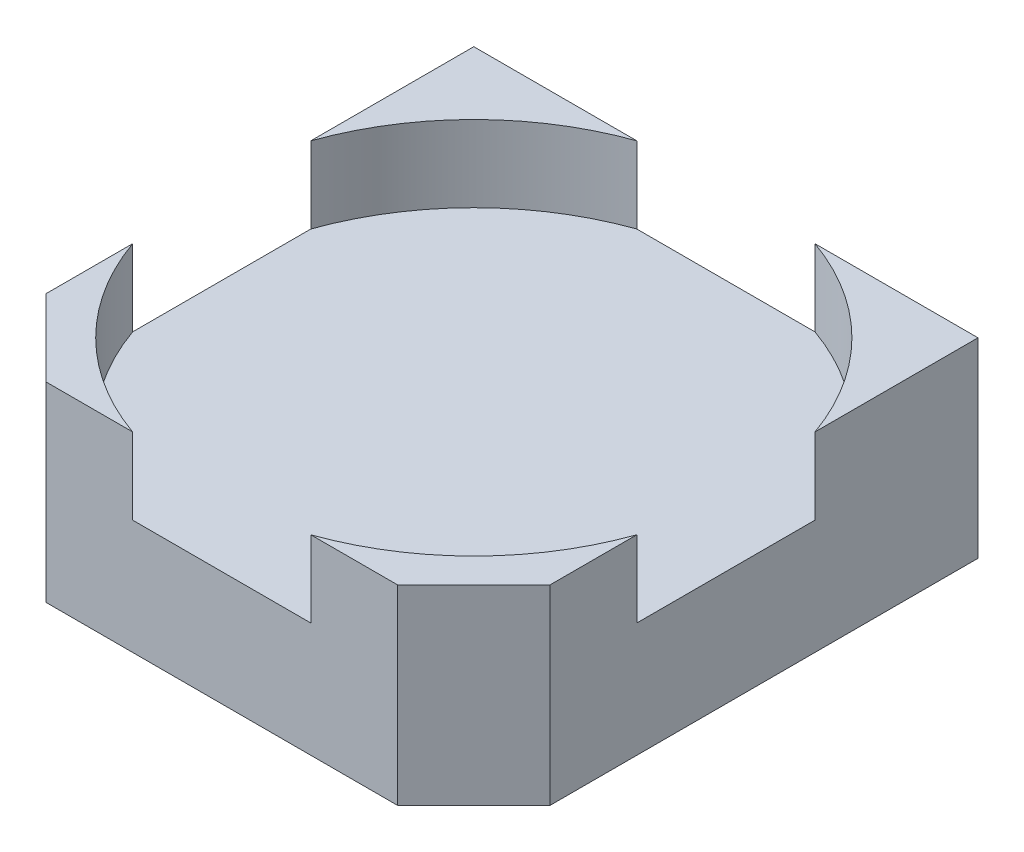
ISO-10303-21;
HEADER;
FILE_DESCRIPTION(('STEP AP214'),'2;1');
FILE_NAME('part.step','',(''),(''),'','','');
FILE_SCHEMA(('AUTOMOTIVE_DESIGN { 1 0 10303 214 1 1 1 1 }'));
ENDSEC;
DATA;
#1=APPLICATION_CONTEXT('core data for automotive mechanical design processes');
#2=APPLICATION_PROTOCOL_DEFINITION('international standard','automotive_design',2000,#1);
#3=PRODUCT_CONTEXT('',#1,'mechanical');
#4=PRODUCT('Part','Part','',(#3));
#5=PRODUCT_RELATED_PRODUCT_CATEGORY('part','',(#4));
#6=PRODUCT_DEFINITION_FORMATION('','',#4);
#7=PRODUCT_DEFINITION_CONTEXT('part definition',#1,'design');
#8=PRODUCT_DEFINITION('design','',#6,#7);
#9=PRODUCT_DEFINITION_SHAPE('','',#8);
#10=(LENGTH_UNIT() NAMED_UNIT(*) SI_UNIT(.MILLI.,.METRE.));
#11=(NAMED_UNIT(*) PLANE_ANGLE_UNIT() SI_UNIT($,.RADIAN.));
#12=(NAMED_UNIT(*) SI_UNIT($,.STERADIAN.) SOLID_ANGLE_UNIT());
#13=UNCERTAINTY_MEASURE_WITH_UNIT(LENGTH_MEASURE(1.E-05),#10,'distance_accuracy_value','');
#14=(GEOMETRIC_REPRESENTATION_CONTEXT(3) GLOBAL_UNCERTAINTY_ASSIGNED_CONTEXT((#13)) GLOBAL_UNIT_ASSIGNED_CONTEXT((#10,
#11,#12)) REPRESENTATION_CONTEXT('',''));
#15=CARTESIAN_POINT('',(0.,0.,0.));
#16=DIRECTION('',(0.,0.,1.));
#17=DIRECTION('',(1.,0.,0.));
#18=AXIS2_PLACEMENT_3D('',#15,#16,#17);
#19=CARTESIAN_POINT('',(0.,0.,0.));
#20=DIRECTION('',(0.,-1.,0.));
#21=DIRECTION('',(0.,0.,-1.));
#22=AXIS2_PLACEMENT_3D('',#19,#20,#21);
#23=PLANE('',#22);
#24=CARTESIAN_POINT('',(0.45,0.,1.1));
#25=CARTESIAN_POINT('',(0.450021735346905,3.18865891521019E-13,1.07464199054861));
#26=CARTESIAN_POINT('',(0.447857862773864,1.9614936058967E-13,1.0492901206923));
#27=CARTESIAN_POINT('',(0.439333080583939,-1.95348438827488E-13,0.999407916028564));
#28=CARTESIAN_POINT('',(0.432989344486768,-4.63531246264136E-13,0.974874649394131));
#29=CARTESIAN_POINT('',(0.416379125480385,-4.18420487480986E-13,0.927512745061029));
#30=CARTESIAN_POINT('',(0.406161741209884,-1.12222877112707E-13,0.904666882019788));
#31=CARTESIAN_POINT('',(0.382088103163854,1.12006036678209E-13,0.860980516002536));
#32=CARTESIAN_POINT('',(0.368231849388324,0.,0.840140013026526));
#33=CARTESIAN_POINT('',(0.337260924502332,0.,0.801039849551722));
#34=CARTESIAN_POINT('',(0.320146253391869,0.,0.782780189052928));
#35=CARTESIAN_POINT('',(0.283131001152919,0.,0.74934515642805));
#36=CARTESIAN_POINT('',(0.263230420024431,0.,0.734169784301966));
#37=CARTESIAN_POINT('',(0.22119210915838,0.,0.707321934121539));
#38=CARTESIAN_POINT('',(0.199054379420816,0.,0.695649456067196));
#39=CARTESIAN_POINT('',(0.153152393130906,0.,0.676129323866148));
#40=CARTESIAN_POINT('',(0.129388136578558,0.,0.668281669719443));
#41=CARTESIAN_POINT('',(0.080888538208529,0.,0.656627637814636));
#42=CARTESIAN_POINT('',(0.0561531963908465,0.,0.652821260056535));
#43=CARTESIAN_POINT('',(0.00639366435553927,0.,0.649354764873312));
#44=CARTESIAN_POINT('',(-0.0186305258620855,0.,0.649694647448189));
#45=CARTESIAN_POINT('',(-0.0682775547990913,0.,0.654511299481692));
#46=CARTESIAN_POINT('',(-0.0929003935184721,0.,0.658988068940317));
#47=CARTESIAN_POINT('',(-0.141065585652177,0.,0.671955016588186));
#48=CARTESIAN_POINT('',(-0.164607939066501,0.,0.68044519477743));
#49=CARTESIAN_POINT('',(-0.209962839149232,0.,0.701204799352918));
#50=CARTESIAN_POINT('',(-0.231775385817638,0.,0.713474225739161));
#51=CARTESIAN_POINT('',(-0.273069020659939,0.,0.741453881589869));
#52=CARTESIAN_POINT('',(-0.292550108833834,0.,0.757164111054333));
#53=CARTESIAN_POINT('',(-0.328643631524891,0.,0.791592204186163));
#54=CARTESIAN_POINT('',(-0.345256066042053,0.,0.81031006785353));
#55=CARTESIAN_POINT('',(-0.375153641169844,0.,0.850236640605053));
#56=CARTESIAN_POINT('',(-0.388438781780473,0.,0.871445349689211));
#57=CARTESIAN_POINT('',(-0.411317014141505,0.,0.915770606421974));
#58=CARTESIAN_POINT('',(-0.420910105891908,0.,0.93888715407058));
#59=CARTESIAN_POINT('',(-0.435612085550015,0.,0.984756631502792));
#60=CARTESIAN_POINT('',(-0.440983104657799,0.,1.00742602133927));
#61=CARTESIAN_POINT('',(-0.448190003756325,0.,1.05339348111672));
#62=CARTESIAN_POINT('',(-0.450014568313984,0.,1.07669332364805));
#63=CARTESIAN_POINT('',(-0.45,0.,1.09999999999891));
#64=B_SPLINE_CURVE_WITH_KNOTS('',3,(#24,#25,#26,#27,#28,#29,#30,#31,#32,#33,#34,#35,#36,#37,#38,
#39,#40,#41,#42,#43,#44,#45,#46,#47,#48,#49,#50,#51,#52,#53,#54,#55,#56,#57,#58,#59,#60,#61,#62,
#63),.UNSPECIFIED.,.F.,.F.,(4,2,2,2,2,2,2,2,2,2,2,2,2,2,2,2,2,2,2,4),(0.,0.0759731758271069,
0.151636136164961,0.226370499235881,0.301104862306801,0.375839225377721,0.45057358844864,
0.52530795151956,0.60004231459048,0.674776677661399,0.749511040732319,0.824245403803239,
0.898979766874158,0.973714129945078,1.048448493016,1.12318285608692,1.19791721915784,
1.27265158222876,1.34226719729782,1.41210456794481),.UNSPECIFIED.);
#65=CARTESIAN_POINT('',(0.45,0.,1.1));
#66=VERTEX_POINT('',#65);
#67=CARTESIAN_POINT('',(-0.45,0.,1.1));
#68=VERTEX_POINT('',#67);
#69=EDGE_CURVE('E48',#66,#68,#64,.T.);
#70=ORIENTED_EDGE('',*,*,#69,.T.);
#71=DIRECTION('',(0.,0.,1.));
#72=VECTOR('',#71,1.);
#73=CARTESIAN_POINT('',(-0.45,0.,0.));
#74=LINE('',#73,#72);
#75=CARTESIAN_POINT('',(-0.45,0.,3.3));
#76=VERTEX_POINT('',#75);
#77=EDGE_CURVE('E11',#68,#76,#74,.T.);
#78=ORIENTED_EDGE('',*,*,#77,.T.);
#79=DIRECTION('',(1.,0.,0.));
#80=VECTOR('',#79,1.);
#81=CARTESIAN_POINT('',(-3.3,0.,3.3));
#82=LINE('',#81,#80);
#83=CARTESIAN_POINT('',(-2.3,0.,3.3));
#84=VERTEX_POINT('',#83);
#85=EDGE_CURVE('E312',#84,#76,#82,.T.);
#86=ORIENTED_EDGE('',*,*,#85,.F.);
#87=DIRECTION('',(0.707106781186546,0.,0.707106781186549));
#88=VECTOR('',#87,1.);
#89=CARTESIAN_POINT('',(-2.8,0.,2.79999999999999));
#90=LINE('',#89,#88);
#91=CARTESIAN_POINT('',(-3.3,0.,2.29999999999999));
#92=VERTEX_POINT('',#91);
#93=EDGE_CURVE('E328',#84,#92,#90,.F.);
#94=ORIENTED_EDGE('',*,*,#93,.T.);
#95=DIRECTION('',(0.,0.,1.));
#96=VECTOR('',#95,1.);
#97=CARTESIAN_POINT('',(-3.3,0.,3.3));
#98=LINE('',#97,#96);
#99=CARTESIAN_POINT('',(-3.3,0.,-3.3));
#100=VERTEX_POINT('',#99);
#101=EDGE_CURVE('E300',#100,#92,#98,.T.);
#102=ORIENTED_EDGE('',*,*,#101,.F.);
#103=DIRECTION('',(-1.,0.,0.));
#104=VECTOR('',#103,1.);
#105=CARTESIAN_POINT('',(-3.3,0.,-3.3));
#106=LINE('',#105,#104);
#107=CARTESIAN_POINT('',(-0.45,0.,-3.3));
#108=VERTEX_POINT('',#107);
#109=EDGE_CURVE('E301',#108,#100,#106,.T.);
#110=ORIENTED_EDGE('',*,*,#109,.F.);
#111=DIRECTION('',(0.,0.,-1.));
#112=VECTOR('',#111,1.);
#113=CARTESIAN_POINT('',(-0.45,0.,0.));
#114=LINE('',#113,#112);
#115=CARTESIAN_POINT('',(-0.45,0.,-1.1));
#116=VERTEX_POINT('',#115);
#117=EDGE_CURVE('E235',#116,#108,#114,.T.);
#118=ORIENTED_EDGE('',*,*,#117,.F.);
#119=CARTESIAN_POINT('',(0.45,0.,-1.1));
#120=CARTESIAN_POINT('',(0.450021735346905,3.18865891521019E-13,-1.07464199054861));
#121=CARTESIAN_POINT('',(0.447857862773864,1.9614936058967E-13,-1.0492901206923));
#122=CARTESIAN_POINT('',(0.439333080583939,-1.95348438827488E-13,-0.999407916028564));
#123=CARTESIAN_POINT('',(0.432989344486768,-4.63531246264136E-13,-0.974874649394131));
#124=CARTESIAN_POINT('',(0.416379125480385,-4.18420487480986E-13,-0.927512745061029));
#125=CARTESIAN_POINT('',(0.406161741209884,-1.12222877112707E-13,-0.904666882019788));
#126=CARTESIAN_POINT('',(0.382088103163854,1.12006036678209E-13,-0.860980516002536));
#127=CARTESIAN_POINT('',(0.368231849388324,0.,-0.840140013026526));
#128=CARTESIAN_POINT('',(0.337260924502332,0.,-0.801039849551722));
#129=CARTESIAN_POINT('',(0.320146253391869,0.,-0.782780189052928));
#130=CARTESIAN_POINT('',(0.283131001152919,0.,-0.74934515642805));
#131=CARTESIAN_POINT('',(0.263230420024431,0.,-0.734169784301966));
#132=CARTESIAN_POINT('',(0.22119210915838,0.,-0.707321934121539));
#133=CARTESIAN_POINT('',(0.199054379420816,0.,-0.695649456067196));
#134=CARTESIAN_POINT('',(0.153152393130906,0.,-0.676129323866148));
#135=CARTESIAN_POINT('',(0.129388136578558,0.,-0.668281669719443));
#136=CARTESIAN_POINT('',(0.080888538208529,0.,-0.656627637814636));
#137=CARTESIAN_POINT('',(0.0561531963908465,0.,-0.652821260056535));
#138=CARTESIAN_POINT('',(0.00639366435553927,0.,-0.649354764873312));
#139=CARTESIAN_POINT('',(-0.0186305258620855,0.,-0.649694647448189));
#140=CARTESIAN_POINT('',(-0.0682775547990913,0.,-0.654511299481692));
#141=CARTESIAN_POINT('',(-0.0929003935184721,0.,-0.658988068940317));
#142=CARTESIAN_POINT('',(-0.141065585652177,0.,-0.671955016588186));
#143=CARTESIAN_POINT('',(-0.164607939066501,0.,-0.68044519477743));
#144=CARTESIAN_POINT('',(-0.209962839149232,0.,-0.701204799352918));
#145=CARTESIAN_POINT('',(-0.231775385817638,0.,-0.713474225739161));
#146=CARTESIAN_POINT('',(-0.273069020659939,0.,-0.741453881589869));
#147=CARTESIAN_POINT('',(-0.292550108833834,0.,-0.757164111054333));
#148=CARTESIAN_POINT('',(-0.328643631524891,0.,-0.791592204186163));
#149=CARTESIAN_POINT('',(-0.345256066042053,0.,-0.81031006785353));
#150=CARTESIAN_POINT('',(-0.375153641169844,0.,-0.850236640605053));
#151=CARTESIAN_POINT('',(-0.388438781780473,0.,-0.871445349689211));
#152=CARTESIAN_POINT('',(-0.411317014141505,0.,-0.915770606421974));
#153=CARTESIAN_POINT('',(-0.420910105891908,0.,-0.93888715407058));
#154=CARTESIAN_POINT('',(-0.435612085550015,0.,-0.984756631502792));
#155=CARTESIAN_POINT('',(-0.440983104657799,0.,-1.00742602133927));
#156=CARTESIAN_POINT('',(-0.448190003756325,0.,-1.05339348111672));
#157=CARTESIAN_POINT('',(-0.450014568313984,0.,-1.07669332364805));
#158=CARTESIAN_POINT('',(-0.45,0.,-1.09999999999891));
#159=B_SPLINE_CURVE_WITH_KNOTS('',3,(#119,#120,#121,#122,#123,#124,#125,#126,#127,#128,#129,
#130,#131,#132,#133,#134,#135,#136,#137,#138,#139,#140,#141,#142,#143,#144,#145,#146,#147,#148,
#149,#150,#151,#152,#153,#154,#155,#156,#157,#158),.UNSPECIFIED.,.F.,.F.,(4,2,2,2,2,2,2,2,2,2,2,
2,2,2,2,2,2,2,2,4),(0.,0.0759731758271069,0.151636136164961,0.226370499235881,0.301104862306801,
0.375839225377721,0.45057358844864,0.52530795151956,0.60004231459048,0.674776677661399,
0.749511040732319,0.824245403803239,0.898979766874158,0.973714129945078,1.048448493016,
1.12318285608692,1.19791721915784,1.27265158222876,1.34226719729782,1.41210456794481),.UNSPECIFIED.);
#160=CARTESIAN_POINT('',(0.45,0.,-1.1));
#161=VERTEX_POINT('',#160);
#162=EDGE_CURVE('E225',#161,#116,#159,.T.);
#163=ORIENTED_EDGE('',*,*,#162,.F.);
#164=DIRECTION('',(0.,0.,1.));
#165=VECTOR('',#164,1.);
#166=CARTESIAN_POINT('',(0.45,0.,0.));
#167=LINE('',#166,#165);
#168=CARTESIAN_POINT('',(0.45,0.,-3.3));
#169=VERTEX_POINT('',#168);
#170=EDGE_CURVE('E234',#169,#161,#167,.T.);
#171=ORIENTED_EDGE('',*,*,#170,.F.);
#172=CARTESIAN_POINT('',(3.3,0.,-3.3));
#173=VERTEX_POINT('',#172);
#174=EDGE_CURVE('E290',#173,#169,#106,.T.);
#175=ORIENTED_EDGE('',*,*,#174,.F.);
#176=DIRECTION('',(0.,0.,-1.));
#177=VECTOR('',#176,1.);
#178=CARTESIAN_POINT('',(3.3,0.,3.3));
#179=LINE('',#178,#177);
#180=CARTESIAN_POINT('',(3.3,0.,2.3));
#181=VERTEX_POINT('',#180);
#182=EDGE_CURVE('E308',#181,#173,#179,.T.);
#183=ORIENTED_EDGE('',*,*,#182,.F.);
#184=DIRECTION('',(0.707106781186549,0.,-0.707106781186546));
#185=VECTOR('',#184,1.);
#186=CARTESIAN_POINT('',(2.79999999999999,0.,2.80000000000001));
#187=LINE('',#186,#185);
#188=CARTESIAN_POINT('',(2.3,0.,3.3));
#189=VERTEX_POINT('',#188);
#190=EDGE_CURVE('E331',#181,#189,#187,.F.);
#191=ORIENTED_EDGE('',*,*,#190,.T.);
#192=CARTESIAN_POINT('',(0.45,0.,3.3));
#193=VERTEX_POINT('',#192);
#194=EDGE_CURVE('E306',#193,#189,#82,.T.);
#195=ORIENTED_EDGE('',*,*,#194,.F.);
#196=DIRECTION('',(0.,0.,-1.));
#197=VECTOR('',#196,1.);
#198=CARTESIAN_POINT('',(0.45,0.,0.));
#199=LINE('',#198,#197);
#200=EDGE_CURVE('E196',#193,#66,#199,.T.);
#201=ORIENTED_EDGE('',*,*,#200,.T.);
#202=EDGE_LOOP('',(#70,#78,#86,#94,#102,#110,#118,#163,#171,#175,#183,#191,#195,#201));
#203=FACE_BOUND('',#202,.T.);
#204=ADVANCED_FACE('F39',(#203),#23,.T.);
#205=CARTESIAN_POINT('',(0.,2.5,0.));
#206=DIRECTION('',(0.,-1.,0.));
#207=DIRECTION('',(0.,0.,-1.));
#208=AXIS2_PLACEMENT_3D('',#205,#206,#207);
#209=PLANE('',#208);
#210=DIRECTION('',(-1.,0.,0.));
#211=VECTOR('',#210,1.);
#212=CARTESIAN_POINT('',(-3.3,2.5,-3.3));
#213=LINE('',#212,#211);
#214=CARTESIAN_POINT('',(3.3,2.5,-3.3));
#215=VERTEX_POINT('',#214);
#216=CARTESIAN_POINT('',(1.16619037896906,2.5,-3.3));
#217=VERTEX_POINT('',#216);
#218=EDGE_CURVE('E390',#215,#217,#213,.T.);
#219=ORIENTED_EDGE('',*,*,#218,.T.);
#220=CARTESIAN_POINT('',(0.,2.5,0.));
#221=DIRECTION('',(0.,-1.,0.));
#222=DIRECTION('',(0.,0.,-1.));
#223=AXIS2_PLACEMENT_3D('',#220,#221,#222);
#224=CIRCLE('',#223,3.5);
#225=CARTESIAN_POINT('',(3.3,2.5,-1.16619037896906));
#226=VERTEX_POINT('',#225);
#227=EDGE_CURVE('E357',#217,#226,#224,.T.);
#228=ORIENTED_EDGE('',*,*,#227,.T.);
#229=DIRECTION('',(0.,0.,-1.));
#230=VECTOR('',#229,1.);
#231=CARTESIAN_POINT('',(3.3,2.5,3.3));
#232=LINE('',#231,#230);
#233=EDGE_CURVE('E316',#226,#215,#232,.T.);
#234=ORIENTED_EDGE('',*,*,#233,.T.);
#235=EDGE_LOOP('',(#219,#228,#234));
#236=FACE_BOUND('',#235,.T.);
#237=ADVANCED_FACE('F242',(#236),#209,.F.);
#238=CARTESIAN_POINT('',(3.3,2.5,2.3));
#239=VERTEX_POINT('',#238);
#240=CARTESIAN_POINT('',(3.3,2.5,1.16619037896906));
#241=VERTEX_POINT('',#240);
#242=EDGE_CURVE('E420',#239,#241,#232,.T.);
#243=ORIENTED_EDGE('',*,*,#242,.T.);
#244=CARTESIAN_POINT('',(0.,2.5,0.));
#245=DIRECTION('',(0.,1.,0.));
#246=DIRECTION('',(0.,0.,1.));
#247=AXIS2_PLACEMENT_3D('',#244,#245,#246);
#248=CIRCLE('',#247,3.5);
#249=CARTESIAN_POINT('',(1.16619037896906,2.5,3.3));
#250=VERTEX_POINT('',#249);
#251=EDGE_CURVE('E408',#250,#241,#248,.T.);
#252=ORIENTED_EDGE('',*,*,#251,.F.);
#253=DIRECTION('',(1.,0.,0.));
#254=VECTOR('',#253,1.);
#255=CARTESIAN_POINT('',(-3.3,2.5,3.3));
#256=LINE('',#255,#254);
#257=CARTESIAN_POINT('',(2.3,2.5,3.3));
#258=VERTEX_POINT('',#257);
#259=EDGE_CURVE('E395',#250,#258,#256,.T.);
#260=ORIENTED_EDGE('',*,*,#259,.T.);
#261=DIRECTION('',(-0.707106781186549,0.,0.707106781186546));
#262=VECTOR('',#261,1.);
#263=CARTESIAN_POINT('',(3.3,2.5,2.3));
#264=LINE('',#263,#262);
#265=EDGE_CURVE('E346',#258,#239,#264,.F.);
#266=ORIENTED_EDGE('',*,*,#265,.T.);
#267=EDGE_LOOP('',(#243,#252,#260,#266));
#268=FACE_BOUND('',#267,.T.);
#269=ADVANCED_FACE('F405',(#268),#209,.F.);
#270=CARTESIAN_POINT('',(-2.3,2.5,3.3));
#271=VERTEX_POINT('',#270);
#272=CARTESIAN_POINT('',(-1.16619037896906,2.5,3.3));
#273=VERTEX_POINT('',#272);
#274=EDGE_CURVE('E321',#271,#273,#256,.T.);
#275=ORIENTED_EDGE('',*,*,#274,.T.);
#276=CARTESIAN_POINT('',(-3.3,2.5,1.16619037896906));
#277=VERTEX_POINT('',#276);
#278=EDGE_CURVE('E356',#273,#277,#224,.T.);
#279=ORIENTED_EDGE('',*,*,#278,.T.);
#280=DIRECTION('',(0.,0.,1.));
#281=VECTOR('',#280,1.);
#282=CARTESIAN_POINT('',(-3.3,2.5,3.3));
#283=LINE('',#282,#281);
#284=CARTESIAN_POINT('',(-3.3,2.5,2.29999999999999));
#285=VERTEX_POINT('',#284);
#286=EDGE_CURVE('E377',#277,#285,#283,.T.);
#287=ORIENTED_EDGE('',*,*,#286,.T.);
#288=DIRECTION('',(-0.707106781186546,0.,-0.707106781186549));
#289=VECTOR('',#288,1.);
#290=CARTESIAN_POINT('',(-2.3,2.5,3.3));
#291=LINE('',#290,#289);
#292=EDGE_CURVE('E343',#285,#271,#291,.F.);
#293=ORIENTED_EDGE('',*,*,#292,.T.);
#294=EDGE_LOOP('',(#275,#279,#287,#293));
#295=FACE_BOUND('',#294,.T.);
#296=ADVANCED_FACE('F376',(#295),#209,.F.);
#297=CARTESIAN_POINT('',(3.3,2.5,3.3));
#298=DIRECTION('',(-1.,0.,0.));
#299=DIRECTION('',(0.,0.,1.));
#300=AXIS2_PLACEMENT_3D('',#297,#298,#299);
#301=PLANE('',#300);
#302=DIRECTION('',(0.,0.,-1.));
#303=VECTOR('',#302,1.);
#304=CARTESIAN_POINT('',(3.3,1.5,3.3));
#305=LINE('',#304,#303);
#306=CARTESIAN_POINT('',(3.3,1.5,1.16619037896906));
#307=VERTEX_POINT('',#306);
#308=CARTESIAN_POINT('',(3.3,1.5,-1.16619037896906));
#309=VERTEX_POINT('',#308);
#310=EDGE_CURVE('E422',#307,#309,#305,.T.);
#311=ORIENTED_EDGE('',*,*,#310,.F.);
#312=DIRECTION('',(0.,1.,0.));
#313=VECTOR('',#312,1.);
#314=CARTESIAN_POINT('',(3.3,1.5,1.16619037896906));
#315=LINE('',#314,#313);
#316=EDGE_CURVE('E446',#307,#241,#315,.T.);
#317=ORIENTED_EDGE('',*,*,#316,.T.);
#318=ORIENTED_EDGE('',*,*,#242,.F.);
#319=DIRECTION('',(0.,-1.,0.));
#320=VECTOR('',#319,1.);
#321=CARTESIAN_POINT('',(3.3,2.5,2.3));
#322=LINE('',#321,#320);
#323=EDGE_CURVE('E324',#239,#181,#322,.T.);
#324=ORIENTED_EDGE('',*,*,#323,.T.);
#325=ORIENTED_EDGE('',*,*,#182,.T.);
#326=DIRECTION('',(0.,-1.,0.));
#327=VECTOR('',#326,1.);
#328=CARTESIAN_POINT('',(3.3,2.5,-3.3));
#329=LINE('',#328,#327);
#330=EDGE_CURVE('E298',#215,#173,#329,.T.);
#331=ORIENTED_EDGE('',*,*,#330,.F.);
#332=ORIENTED_EDGE('',*,*,#233,.F.);
#333=DIRECTION('',(0.,1.,0.));
#334=VECTOR('',#333,1.);
#335=CARTESIAN_POINT('',(3.3,1.5,-1.16619037896906));
#336=LINE('',#335,#334);
#337=EDGE_CURVE('E441',#226,#309,#336,.F.);
#338=ORIENTED_EDGE('',*,*,#337,.T.);
#339=EDGE_LOOP('',(#311,#317,#318,#324,#325,#331,#332,#338));
#340=FACE_BOUND('',#339,.T.);
#341=ADVANCED_FACE('F418',(#340),#301,.F.);
#342=CARTESIAN_POINT('',(-3.3,2.5,-3.3));
#343=DIRECTION('',(0.,0.,1.));
#344=DIRECTION('',(1.,0.,0.));
#345=AXIS2_PLACEMENT_3D('',#342,#343,#344);
#346=PLANE('',#345);
#347=DIRECTION('',(-1.,0.,0.));
#348=VECTOR('',#347,1.);
#349=CARTESIAN_POINT('',(-3.3,1.5,-3.3));
#350=LINE('',#349,#348);
#351=CARTESIAN_POINT('',(1.16619037896906,1.5,-3.3));
#352=VERTEX_POINT('',#351);
#353=CARTESIAN_POINT('',(-1.16619037896906,1.5,-3.3));
#354=VERTEX_POINT('',#353);
#355=EDGE_CURVE('E424',#352,#354,#350,.T.);
#356=ORIENTED_EDGE('',*,*,#355,.F.);
#357=DIRECTION('',(0.,1.,0.));
#358=VECTOR('',#357,1.);
#359=CARTESIAN_POINT('',(1.16619037896906,1.5,-3.3));
#360=LINE('',#359,#358);
#361=EDGE_CURVE('E437',#352,#217,#360,.T.);
#362=ORIENTED_EDGE('',*,*,#361,.T.);
#363=ORIENTED_EDGE('',*,*,#218,.F.);
#364=ORIENTED_EDGE('',*,*,#330,.T.);
#365=ORIENTED_EDGE('',*,*,#174,.T.);
#366=DIRECTION('',(-1.,0.,0.));
#367=VECTOR('',#366,1.);
#368=CARTESIAN_POINT('',(0.45,0.,-3.3));
#369=LINE('',#368,#367);
#370=EDGE_CURVE('E208',#169,#108,#369,.T.);
#371=ORIENTED_EDGE('',*,*,#370,.T.);
#372=ORIENTED_EDGE('',*,*,#109,.T.);
#373=DIRECTION('',(0.,-1.,0.));
#374=VECTOR('',#373,1.);
#375=CARTESIAN_POINT('',(-3.3,2.5,-3.3));
#376=LINE('',#375,#374);
#377=CARTESIAN_POINT('',(-3.3,2.5,-3.3));
#378=VERTEX_POINT('',#377);
#379=EDGE_CURVE('E317',#378,#100,#376,.T.);
#380=ORIENTED_EDGE('',*,*,#379,.F.);
#381=CARTESIAN_POINT('',(-1.16619037896906,2.5,-3.3));
#382=VERTEX_POINT('',#381);
#383=EDGE_CURVE('E396',#382,#378,#213,.T.);
#384=ORIENTED_EDGE('',*,*,#383,.F.);
#385=DIRECTION('',(0.,1.,0.));
#386=VECTOR('',#385,1.);
#387=CARTESIAN_POINT('',(-1.16619037896906,1.5,-3.3));
#388=LINE('',#387,#386);
#389=EDGE_CURVE('E442',#382,#354,#388,.F.);
#390=ORIENTED_EDGE('',*,*,#389,.T.);
#391=EDGE_LOOP('',(#356,#362,#363,#364,#365,#371,#372,#380,#384,#390));
#392=FACE_BOUND('',#391,.T.);
#393=ADVANCED_FACE('F295',(#392),#346,.F.);
#394=CARTESIAN_POINT('',(-3.3,2.5,3.3));
#395=DIRECTION('',(1.,0.,0.));
#396=DIRECTION('',(0.,0.,-1.));
#397=AXIS2_PLACEMENT_3D('',#394,#395,#396);
#398=PLANE('',#397);
#399=DIRECTION('',(0.,0.,1.));
#400=VECTOR('',#399,1.);
#401=CARTESIAN_POINT('',(-3.3,1.5,3.3));
#402=LINE('',#401,#400);
#403=CARTESIAN_POINT('',(-3.3,1.5,-1.16619037896906));
#404=VERTEX_POINT('',#403);
#405=CARTESIAN_POINT('',(-3.3,1.5,1.16619037896906));
#406=VERTEX_POINT('',#405);
#407=EDGE_CURVE('E429',#404,#406,#402,.T.);
#408=ORIENTED_EDGE('',*,*,#407,.F.);
#409=DIRECTION('',(0.,1.,0.));
#410=VECTOR('',#409,1.);
#411=CARTESIAN_POINT('',(-3.3,1.5,-1.16619037896906));
#412=LINE('',#411,#410);
#413=CARTESIAN_POINT('',(-3.3,2.5,-1.16619037896906));
#414=VERTEX_POINT('',#413);
#415=EDGE_CURVE('E448',#404,#414,#412,.T.);
#416=ORIENTED_EDGE('',*,*,#415,.T.);
#417=EDGE_CURVE('E389',#378,#414,#283,.T.);
#418=ORIENTED_EDGE('',*,*,#417,.F.);
#419=ORIENTED_EDGE('',*,*,#379,.T.);
#420=ORIENTED_EDGE('',*,*,#101,.T.);
#421=DIRECTION('',(0.,1.,0.));
#422=VECTOR('',#421,1.);
#423=CARTESIAN_POINT('',(-3.3,2.5,2.29999999999999));
#424=LINE('',#423,#422);
#425=EDGE_CURVE('E349',#92,#285,#424,.T.);
#426=ORIENTED_EDGE('',*,*,#425,.T.);
#427=ORIENTED_EDGE('',*,*,#286,.F.);
#428=DIRECTION('',(0.,1.,0.));
#429=VECTOR('',#428,1.);
#430=CARTESIAN_POINT('',(-3.3,1.5,1.16619037896906));
#431=LINE('',#430,#429);
#432=EDGE_CURVE('E385',#277,#406,#431,.F.);
#433=ORIENTED_EDGE('',*,*,#432,.T.);
#434=EDGE_LOOP('',(#408,#416,#418,#419,#420,#426,#427,#433));
#435=FACE_BOUND('',#434,.T.);
#436=ADVANCED_FACE('F384',(#435),#398,.F.);
#437=CARTESIAN_POINT('',(-3.3,2.5,3.3));
#438=DIRECTION('',(0.,0.,-1.));
#439=DIRECTION('',(-1.,0.,0.));
#440=AXIS2_PLACEMENT_3D('',#437,#438,#439);
#441=PLANE('',#440);
#442=DIRECTION('',(1.,0.,0.));
#443=VECTOR('',#442,1.);
#444=CARTESIAN_POINT('',(-3.3,1.5,3.3));
#445=LINE('',#444,#443);
#446=CARTESIAN_POINT('',(-1.16619037896906,1.5,3.3));
#447=VERTEX_POINT('',#446);
#448=CARTESIAN_POINT('',(1.16619037896906,1.5,3.3));
#449=VERTEX_POINT('',#448);
#450=EDGE_CURVE('E358',#447,#449,#445,.T.);
#451=ORIENTED_EDGE('',*,*,#450,.F.);
#452=DIRECTION('',(0.,1.,0.));
#453=VECTOR('',#452,1.);
#454=CARTESIAN_POINT('',(-1.16619037896906,1.5,3.3));
#455=LINE('',#454,#453);
#456=EDGE_CURVE('E462',#447,#273,#455,.T.);
#457=ORIENTED_EDGE('',*,*,#456,.T.);
#458=ORIENTED_EDGE('',*,*,#274,.F.);
#459=DIRECTION('',(0.,-1.,0.));
#460=VECTOR('',#459,1.);
#461=CARTESIAN_POINT('',(-2.3,2.5,3.3));
#462=LINE('',#461,#460);
#463=EDGE_CURVE('E335',#271,#84,#462,.T.);
#464=ORIENTED_EDGE('',*,*,#463,.T.);
#465=ORIENTED_EDGE('',*,*,#85,.T.);
#466=DIRECTION('',(-1.,0.,0.));
#467=VECTOR('',#466,1.);
#468=CARTESIAN_POINT('',(0.45,0.,3.3));
#469=LINE('',#468,#467);
#470=EDGE_CURVE('E199',#193,#76,#469,.T.);
#471=ORIENTED_EDGE('',*,*,#470,.F.);
#472=ORIENTED_EDGE('',*,*,#194,.T.);
#473=DIRECTION('',(0.,1.,0.));
#474=VECTOR('',#473,1.);
#475=CARTESIAN_POINT('',(2.3,2.5,3.3));
#476=LINE('',#475,#474);
#477=EDGE_CURVE('E339',#189,#258,#476,.T.);
#478=ORIENTED_EDGE('',*,*,#477,.T.);
#479=ORIENTED_EDGE('',*,*,#259,.F.);
#480=DIRECTION('',(0.,1.,0.));
#481=VECTOR('',#480,1.);
#482=CARTESIAN_POINT('',(1.16619037896906,1.5,3.3));
#483=LINE('',#482,#481);
#484=EDGE_CURVE('E472',#250,#449,#483,.F.);
#485=ORIENTED_EDGE('',*,*,#484,.T.);
#486=EDGE_LOOP('',(#451,#457,#458,#464,#465,#471,#472,#478,#479,#485));
#487=FACE_BOUND('',#486,.T.);
#488=ADVANCED_FACE('F246',(#487),#441,.F.);
#489=ORIENTED_EDGE('',*,*,#417,.T.);
#490=EDGE_CURVE('E353',#414,#382,#224,.T.);
#491=ORIENTED_EDGE('',*,*,#490,.T.);
#492=ORIENTED_EDGE('',*,*,#383,.T.);
#493=EDGE_LOOP('',(#489,#491,#492));
#494=FACE_BOUND('',#493,.T.);
#495=ADVANCED_FACE('F244',(#494),#209,.F.);
#496=CARTESIAN_POINT('',(3.3,2.5,2.3));
#497=DIRECTION('',(-0.707106781186546,0.,-0.707106781186549));
#498=DIRECTION('',(0.,-1.,0.));
#499=AXIS2_PLACEMENT_3D('',#496,#497,#498);
#500=PLANE('',#499);
#501=ORIENTED_EDGE('',*,*,#265,.F.);
#502=ORIENTED_EDGE('',*,*,#477,.F.);
#503=ORIENTED_EDGE('',*,*,#190,.F.);
#504=ORIENTED_EDGE('',*,*,#323,.F.);
#505=EDGE_LOOP('',(#501,#502,#503,#504));
#506=FACE_BOUND('',#505,.T.);
#507=ADVANCED_FACE('F415',(#506),#500,.F.);
#508=CARTESIAN_POINT('',(-2.3,2.5,3.3));
#509=DIRECTION('',(0.707106781186549,0.,-0.707106781186546));
#510=DIRECTION('',(0.,-1.,0.));
#511=AXIS2_PLACEMENT_3D('',#508,#509,#510);
#512=PLANE('',#511);
#513=ORIENTED_EDGE('',*,*,#292,.F.);
#514=ORIENTED_EDGE('',*,*,#425,.F.);
#515=ORIENTED_EDGE('',*,*,#93,.F.);
#516=ORIENTED_EDGE('',*,*,#463,.F.);
#517=EDGE_LOOP('',(#513,#514,#515,#516));
#518=FACE_BOUND('',#517,.T.);
#519=ADVANCED_FACE('F41',(#518),#512,.F.);
#520=CARTESIAN_POINT('',(0.,1.5,0.));
#521=DIRECTION('',(0.,1.,0.));
#522=DIRECTION('',(0.,0.,1.));
#523=AXIS2_PLACEMENT_3D('',#520,#521,#522);
#524=PLANE('',#523);
#525=ORIENTED_EDGE('',*,*,#310,.T.);
#526=CARTESIAN_POINT('',(0.,1.5,0.));
#527=DIRECTION('',(0.,1.,0.));
#528=DIRECTION('',(0.,0.,1.));
#529=AXIS2_PLACEMENT_3D('',#526,#527,#528);
#530=CIRCLE('',#529,3.5);
#531=EDGE_CURVE('E468',#309,#352,#530,.T.);
#532=ORIENTED_EDGE('',*,*,#531,.T.);
#533=ORIENTED_EDGE('',*,*,#355,.T.);
#534=EDGE_CURVE('E459',#354,#404,#530,.T.);
#535=ORIENTED_EDGE('',*,*,#534,.T.);
#536=ORIENTED_EDGE('',*,*,#407,.T.);
#537=EDGE_CURVE('E457',#406,#447,#530,.T.);
#538=ORIENTED_EDGE('',*,*,#537,.T.);
#539=ORIENTED_EDGE('',*,*,#450,.T.);
#540=EDGE_CURVE('E465',#449,#307,#530,.T.);
#541=ORIENTED_EDGE('',*,*,#540,.T.);
#542=EDGE_LOOP('',(#525,#532,#533,#535,#536,#538,#539,#541));
#543=FACE_BOUND('',#542,.T.);
#544=ADVANCED_FACE('F456',(#543),#524,.T.);
#545=CARTESIAN_POINT('',(0.,1.5,0.));
#546=DIRECTION('',(0.,1.,0.));
#547=DIRECTION('',(0.,0.,1.));
#548=AXIS2_PLACEMENT_3D('',#545,#546,#547);
#549=CYLINDRICAL_SURFACE('',#548,3.5);
#550=ORIENTED_EDGE('',*,*,#540,.F.);
#551=ORIENTED_EDGE('',*,*,#484,.F.);
#552=ORIENTED_EDGE('',*,*,#251,.T.);
#553=ORIENTED_EDGE('',*,*,#316,.F.);
#554=EDGE_LOOP('',(#550,#551,#552,#553));
#555=FACE_BOUND('',#554,.T.);
#556=ADVANCED_FACE('F478',(#555),#549,.F.);
#557=ORIENTED_EDGE('',*,*,#227,.F.);
#558=ORIENTED_EDGE('',*,*,#361,.F.);
#559=ORIENTED_EDGE('',*,*,#531,.F.);
#560=ORIENTED_EDGE('',*,*,#337,.F.);
#561=EDGE_LOOP('',(#557,#558,#559,#560));
#562=FACE_BOUND('',#561,.T.);
#563=ADVANCED_FACE('F476',(#562),#549,.F.);
#564=ORIENTED_EDGE('',*,*,#490,.F.);
#565=ORIENTED_EDGE('',*,*,#415,.F.);
#566=ORIENTED_EDGE('',*,*,#534,.F.);
#567=ORIENTED_EDGE('',*,*,#389,.F.);
#568=EDGE_LOOP('',(#564,#565,#566,#567));
#569=FACE_BOUND('',#568,.T.);
#570=ADVANCED_FACE('F547',(#569),#549,.F.);
#571=ORIENTED_EDGE('',*,*,#278,.F.);
#572=ORIENTED_EDGE('',*,*,#456,.F.);
#573=ORIENTED_EDGE('',*,*,#537,.F.);
#574=ORIENTED_EDGE('',*,*,#432,.F.);
#575=EDGE_LOOP('',(#571,#572,#573,#574));
#576=FACE_BOUND('',#575,.T.);
#577=ADVANCED_FACE('F461',(#576),#549,.F.);
#578=CARTESIAN_POINT('',(0.45,-0.398536139066789,-3.27584629460201));
#579=DIRECTION('',(1.,0.,0.));
#580=DIRECTION('',(0.,0.,-1.));
#581=AXIS2_PLACEMENT_3D('',#578,#579,#580);
#582=PLANE('',#581);
#583=ORIENTED_EDGE('',*,*,#170,.T.);
#584=DIRECTION('',(0.,0.998168496631191,-0.0604950604018904));
#585=VECTOR('',#584,1.);
#586=CARTESIAN_POINT('',(0.45,-0.265690759377859,-1.08389752973468));
#587=LINE('',#586,#585);
#588=CARTESIAN_POINT('',(0.45,0.13284537968893,-1.10805123513266));
#589=VERTEX_POINT('',#588);
#590=EDGE_CURVE('E281',#161,#589,#587,.T.);
#591=ORIENTED_EDGE('',*,*,#590,.T.);
#592=DIRECTION('',(0.,-0.0604950604018904,-0.998168496631191));
#593=VECTOR('',#592,1.);
#594=CARTESIAN_POINT('',(0.45,0.,-3.3));
#595=LINE('',#594,#593);
#596=EDGE_CURVE('E274',#589,#169,#595,.T.);
#597=ORIENTED_EDGE('',*,*,#596,.T.);
#598=EDGE_LOOP('',(#583,#591,#597));
#599=FACE_BOUND('',#598,.T.);
#600=ADVANCED_FACE('F220',(#599),#582,.F.);
#601=CARTESIAN_POINT('',(0.,-0.265690759377859,-1.08389752973468));
#602=DIRECTION('',(0.,0.998168496631191,-0.0604950604018904));
#603=DIRECTION('',(1.,0.,0.));
#604=AXIS2_PLACEMENT_3D('',#601,#602,#603);
#605=ELLIPSE('',#604,0.45,0.449175823484036);
#606=DIRECTION('',(0.,0.998168496631191,-0.0604950604018904));
#607=VECTOR('',#606,1.);
#608=SURFACE_OF_LINEAR_EXTRUSION('',#605,#607);
#609=ORIENTED_EDGE('',*,*,#162,.T.);
#610=DIRECTION('',(0.,0.998168496631191,-0.0604950604018904));
#611=VECTOR('',#610,1.);
#612=CARTESIAN_POINT('',(-0.45,-0.265690759377859,-1.08389752973468));
#613=LINE('',#612,#611);
#614=CARTESIAN_POINT('',(-0.45,0.13284537968893,-1.10805123513266));
#615=VERTEX_POINT('',#614);
#616=EDGE_CURVE('E284',#116,#615,#613,.T.);
#617=ORIENTED_EDGE('',*,*,#616,.T.);
#618=CARTESIAN_POINT('',(0.,0.13284537968893,-1.10805123513266));
#619=DIRECTION('',(0.,0.998168496631191,-0.0604950604018904));
#620=DIRECTION('',(1.,0.,0.));
#621=AXIS2_PLACEMENT_3D('',#618,#619,#620);
#622=ELLIPSE('',#621,0.45,0.449175823484036);
#623=EDGE_CURVE('E285',#615,#589,#622,.T.);
#624=ORIENTED_EDGE('',*,*,#623,.T.);
#625=ORIENTED_EDGE('',*,*,#590,.F.);
#626=EDGE_LOOP('',(#609,#617,#624,#625));
#627=FACE_BOUND('',#626,.T.);
#628=ADVANCED_FACE('F214',(#627),#608,.F.);
#629=CARTESIAN_POINT('',(-0.45,-0.398536139066789,-3.27584629460201));
#630=DIRECTION('',(-1.,0.,0.));
#631=DIRECTION('',(0.,0.,1.));
#632=AXIS2_PLACEMENT_3D('',#629,#630,#631);
#633=PLANE('',#632);
#634=ORIENTED_EDGE('',*,*,#117,.T.);
#635=DIRECTION('',(0.,0.0604950604018904,0.998168496631191));
#636=VECTOR('',#635,1.);
#637=CARTESIAN_POINT('',(-0.45,0.,-3.3));
#638=LINE('',#637,#636);
#639=EDGE_CURVE('E63',#108,#615,#638,.T.);
#640=ORIENTED_EDGE('',*,*,#639,.T.);
#641=ORIENTED_EDGE('',*,*,#616,.F.);
#642=EDGE_LOOP('',(#634,#640,#641));
#643=FACE_BOUND('',#642,.T.);
#644=ADVANCED_FACE('F219',(#643),#633,.F.);
#645=CARTESIAN_POINT('',(0.,0.13284537968893,-1.10805123513266));
#646=DIRECTION('',(0.,0.998168496631191,-0.0604950604018904));
#647=DIRECTION('',(0.,0.0604950604018904,0.998168496631191));
#648=AXIS2_PLACEMENT_3D('',#645,#646,#647);
#649=PLANE('',#648);
#650=ORIENTED_EDGE('',*,*,#370,.F.);
#651=ORIENTED_EDGE('',*,*,#596,.F.);
#652=ORIENTED_EDGE('',*,*,#623,.F.);
#653=ORIENTED_EDGE('',*,*,#639,.F.);
#654=EDGE_LOOP('',(#650,#651,#652,#653));
#655=FACE_BOUND('',#654,.T.);
#656=ADVANCED_FACE('F263',(#655),#649,.F.);
#657=CARTESIAN_POINT('',(-0.45,-0.398536139066789,3.27584629460201));
#658=DIRECTION('',(1.,0.,0.));
#659=DIRECTION('',(0.,0.,-1.));
#660=AXIS2_PLACEMENT_3D('',#657,#658,#659);
#661=PLANE('',#660);
#662=DIRECTION('',(0.,0.998168496631191,0.0604950604018904));
#663=VECTOR('',#662,1.);
#664=CARTESIAN_POINT('',(-0.45,-0.265690759377859,1.08389752973468));
#665=LINE('',#664,#663);
#666=CARTESIAN_POINT('',(-0.45,0.13284537968893,1.10805123513266));
#667=VERTEX_POINT('',#666);
#668=EDGE_CURVE('E188',#68,#667,#665,.T.);
#669=ORIENTED_EDGE('',*,*,#668,.T.);
#670=DIRECTION('',(0.,0.0604950604018904,-0.998168496631191));
#671=VECTOR('',#670,1.);
#672=CARTESIAN_POINT('',(-0.45,0.,3.3));
#673=LINE('',#672,#671);
#674=EDGE_CURVE('E189',#76,#667,#673,.T.);
#675=ORIENTED_EDGE('',*,*,#674,.F.);
#676=ORIENTED_EDGE('',*,*,#77,.F.);
#677=EDGE_LOOP('',(#669,#675,#676));
#678=FACE_BOUND('',#677,.T.);
#679=ADVANCED_FACE('F259',(#678),#661,.T.);
#680=CARTESIAN_POINT('',(0.,-0.265690759377859,1.08389752973468));
#681=DIRECTION('',(0.,-0.998168496631191,-0.0604950604018904));
#682=DIRECTION('',(1.,0.,0.));
#683=AXIS2_PLACEMENT_3D('',#680,#681,#682);
#684=ELLIPSE('',#683,0.45,0.449175823484036);
#685=DIRECTION('',(0.,0.998168496631191,0.0604950604018904));
#686=VECTOR('',#685,1.);
#687=SURFACE_OF_LINEAR_EXTRUSION('',#684,#686);
#688=DIRECTION('',(0.,0.998168496631191,0.0604950604018904));
#689=VECTOR('',#688,1.);
#690=CARTESIAN_POINT('',(0.45,-0.265690759377859,1.08389752973468));
#691=LINE('',#690,#689);
#692=CARTESIAN_POINT('',(0.45,0.13284537968893,1.10805123513266));
#693=VERTEX_POINT('',#692);
#694=EDGE_CURVE('E180',#66,#693,#691,.T.);
#695=ORIENTED_EDGE('',*,*,#694,.T.);
#696=CARTESIAN_POINT('',(0.,0.13284537968893,1.10805123513266));
#697=DIRECTION('',(0.,-0.998168496631191,-0.0604950604018904));
#698=DIRECTION('',(1.,0.,0.));
#699=AXIS2_PLACEMENT_3D('',#696,#697,#698);
#700=ELLIPSE('',#699,0.45,0.449175823484036);
#701=EDGE_CURVE('E183',#667,#693,#700,.T.);
#702=ORIENTED_EDGE('',*,*,#701,.F.);
#703=ORIENTED_EDGE('',*,*,#668,.F.);
#704=ORIENTED_EDGE('',*,*,#69,.F.);
#705=EDGE_LOOP('',(#695,#702,#703,#704));
#706=FACE_BOUND('',#705,.T.);
#707=ADVANCED_FACE('F181',(#706),#687,.T.);
#708=CARTESIAN_POINT('',(0.45,-0.398536139066789,3.27584629460201));
#709=DIRECTION('',(-1.,0.,0.));
#710=DIRECTION('',(0.,0.,1.));
#711=AXIS2_PLACEMENT_3D('',#708,#709,#710);
#712=PLANE('',#711);
#713=DIRECTION('',(0.,-0.0604950604018904,0.998168496631191));
#714=VECTOR('',#713,1.);
#715=CARTESIAN_POINT('',(0.45,0.,3.3));
#716=LINE('',#715,#714);
#717=EDGE_CURVE('E55',#693,#193,#716,.T.);
#718=ORIENTED_EDGE('',*,*,#717,.F.);
#719=ORIENTED_EDGE('',*,*,#694,.F.);
#720=ORIENTED_EDGE('',*,*,#200,.F.);
#721=EDGE_LOOP('',(#718,#719,#720));
#722=FACE_BOUND('',#721,.T.);
#723=ADVANCED_FACE('F195',(#722),#712,.T.);
#724=CARTESIAN_POINT('',(0.,0.13284537968893,1.10805123513266));
#725=DIRECTION('',(0.,0.998168496631191,0.0604950604018904));
#726=DIRECTION('',(0.,0.0604950604018904,-0.998168496631191));
#727=AXIS2_PLACEMENT_3D('',#724,#725,#726);
#728=PLANE('',#727);
#729=ORIENTED_EDGE('',*,*,#470,.T.);
#730=ORIENTED_EDGE('',*,*,#674,.T.);
#731=ORIENTED_EDGE('',*,*,#701,.T.);
#732=ORIENTED_EDGE('',*,*,#717,.T.);
#733=EDGE_LOOP('',(#729,#730,#731,#732));
#734=FACE_BOUND('',#733,.T.);
#735=ADVANCED_FACE('F192',(#734),#728,.F.);
#736=CLOSED_SHELL('',(#204,#237,#269,#296,#341,#393,#436,#488,#495,#507,#519,#544,#556,#563,
#570,#577,#600,#628,#644,#656,#679,#707,#723,#735));
#737=MANIFOLD_SOLID_BREP('B2',#736);
#738=ADVANCED_BREP_SHAPE_REPRESENTATION('',(#18,#737),#14);
#739=SHAPE_DEFINITION_REPRESENTATION(#9,#738);
ENDSEC;
END-ISO-10303-21;
